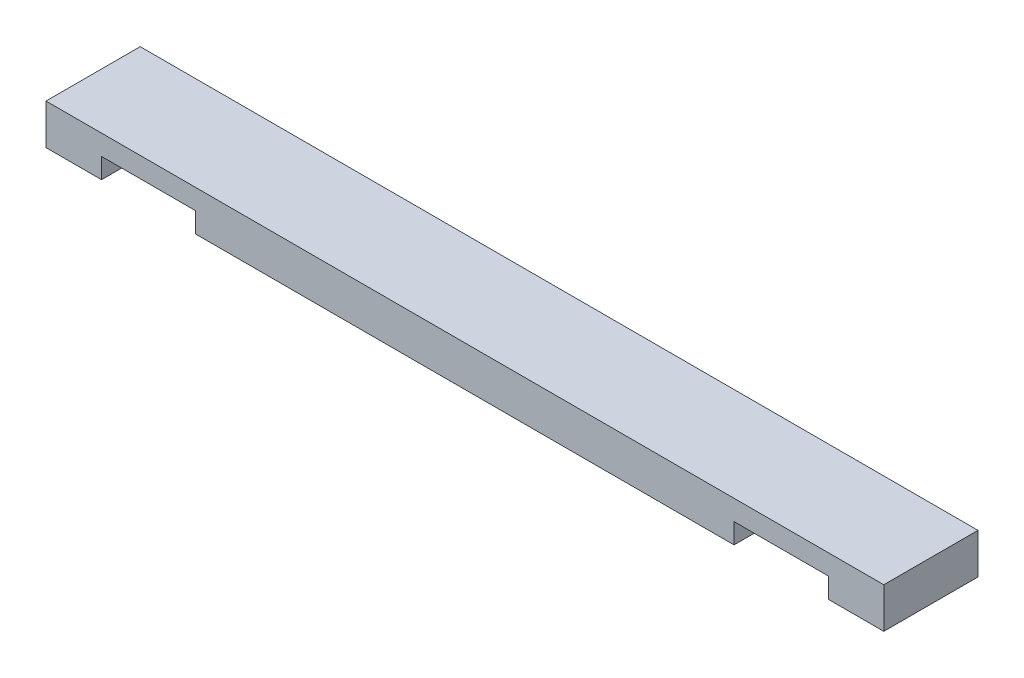
ISO-10303-21;
HEADER;
FILE_DESCRIPTION(('STEP AP214'),'2;1');
FILE_NAME('part.step','',(''),(''),'','','');
FILE_SCHEMA(('AUTOMOTIVE_DESIGN { 1 0 10303 214 1 1 1 1 }'));
ENDSEC;
DATA;
#1=APPLICATION_CONTEXT('core data for automotive mechanical design processes');
#2=APPLICATION_PROTOCOL_DEFINITION('international standard','automotive_design',2000,#1);
#3=PRODUCT_CONTEXT('',#1,'mechanical');
#4=PRODUCT('Part','Part','',(#3));
#5=PRODUCT_RELATED_PRODUCT_CATEGORY('part','',(#4));
#6=PRODUCT_DEFINITION_FORMATION('','',#4);
#7=PRODUCT_DEFINITION_CONTEXT('part definition',#1,'design');
#8=PRODUCT_DEFINITION('design','',#6,#7);
#9=PRODUCT_DEFINITION_SHAPE('','',#8);
#10=(LENGTH_UNIT() NAMED_UNIT(*) SI_UNIT(.MILLI.,.METRE.));
#11=(NAMED_UNIT(*) PLANE_ANGLE_UNIT() SI_UNIT($,.RADIAN.));
#12=(NAMED_UNIT(*) SI_UNIT($,.STERADIAN.) SOLID_ANGLE_UNIT());
#13=UNCERTAINTY_MEASURE_WITH_UNIT(LENGTH_MEASURE(1.E-05),#10,'distance_accuracy_value','');
#14=(GEOMETRIC_REPRESENTATION_CONTEXT(3) GLOBAL_UNCERTAINTY_ASSIGNED_CONTEXT((#13)) GLOBAL_UNIT_ASSIGNED_CONTEXT((#10,
#11,#12)) REPRESENTATION_CONTEXT('',''));
#15=CARTESIAN_POINT('',(0.,0.,0.));
#16=DIRECTION('',(0.,0.,1.));
#17=DIRECTION('',(1.,0.,0.));
#18=AXIS2_PLACEMENT_3D('',#15,#16,#17);
#19=CARTESIAN_POINT('',(0.,0.,0.));
#20=DIRECTION('',(0.,-1.,0.));
#21=DIRECTION('',(0.,0.,-1.));
#22=AXIS2_PLACEMENT_3D('',#19,#20,#21);
#23=PLANE('',#22);
#24=DIRECTION('',(0.,0.,1.));
#25=VECTOR('',#24,1.);
#26=CARTESIAN_POINT('',(738.187500000009,0.,-88.9));
#27=LINE('',#26,#25);
#28=CARTESIAN_POINT('',(738.187500000009,0.,-88.9));
#29=VERTEX_POINT('',#28);
#30=CARTESIAN_POINT('',(738.187500000009,0.,0.));
#31=VERTEX_POINT('',#30);
#32=EDGE_CURVE('E161',#29,#31,#27,.T.);
#33=ORIENTED_EDGE('',*,*,#32,.F.);
#34=DIRECTION('',(-1.,0.,0.));
#35=VECTOR('',#34,1.);
#36=CARTESIAN_POINT('',(0.,0.,-88.9));
#37=LINE('',#36,#35);
#38=CARTESIAN_POINT('',(790.575,0.,-88.9));
#39=VERTEX_POINT('',#38);
#40=EDGE_CURVE('E152',#39,#29,#37,.T.);
#41=ORIENTED_EDGE('',*,*,#40,.F.);
#42=DIRECTION('',(0.,0.,-1.));
#43=VECTOR('',#42,1.);
#44=CARTESIAN_POINT('',(790.575,0.,0.));
#45=LINE('',#44,#43);
#46=CARTESIAN_POINT('',(790.575,0.,0.));
#47=VERTEX_POINT('',#46);
#48=EDGE_CURVE('E206',#47,#39,#45,.T.);
#49=ORIENTED_EDGE('',*,*,#48,.F.);
#50=DIRECTION('',(1.,0.,0.));
#51=VECTOR('',#50,1.);
#52=CARTESIAN_POINT('',(0.,0.,0.));
#53=LINE('',#52,#51);
#54=EDGE_CURVE('E202',#31,#47,#53,.T.);
#55=ORIENTED_EDGE('',*,*,#54,.F.);
#56=EDGE_LOOP('',(#33,#41,#49,#55));
#57=FACE_BOUND('',#56,.T.);
#58=ADVANCED_FACE('F39',(#57),#23,.T.);
#59=DIRECTION('',(0.,0.,1.));
#60=VECTOR('',#59,1.);
#61=CARTESIAN_POINT('',(649.287500000009,0.,-88.9));
#62=LINE('',#61,#60);
#63=CARTESIAN_POINT('',(649.287500000009,0.,-88.9));
#64=VERTEX_POINT('',#63);
#65=CARTESIAN_POINT('',(649.287500000008,0.,0.));
#66=VERTEX_POINT('',#65);
#67=EDGE_CURVE('E164',#64,#66,#62,.T.);
#68=ORIENTED_EDGE('',*,*,#67,.T.);
#69=CARTESIAN_POINT('',(141.300199999996,0.,0.));
#70=VERTEX_POINT('',#69);
#71=EDGE_CURVE('E207',#70,#66,#53,.T.);
#72=ORIENTED_EDGE('',*,*,#71,.F.);
#73=DIRECTION('',(0.,0.,1.));
#74=VECTOR('',#73,1.);
#75=CARTESIAN_POINT('',(141.300199999996,0.,-88.9));
#76=LINE('',#75,#74);
#77=CARTESIAN_POINT('',(141.300199999996,0.,-88.9));
#78=VERTEX_POINT('',#77);
#79=EDGE_CURVE('E174',#78,#70,#76,.T.);
#80=ORIENTED_EDGE('',*,*,#79,.F.);
#81=EDGE_CURVE('E211',#64,#78,#37,.T.);
#82=ORIENTED_EDGE('',*,*,#81,.F.);
#83=EDGE_LOOP('',(#68,#72,#80,#82));
#84=FACE_BOUND('',#83,.T.);
#85=ADVANCED_FACE('F232',(#84),#23,.T.);
#86=CARTESIAN_POINT('',(0.,38.1,0.));
#87=DIRECTION('',(1.,0.,0.));
#88=DIRECTION('',(0.,0.,-1.));
#89=AXIS2_PLACEMENT_3D('',#86,#87,#88);
#90=PLANE('',#89);
#91=DIRECTION('',(0.,0.,1.));
#92=VECTOR('',#91,1.);
#93=CARTESIAN_POINT('',(0.,0.,0.));
#94=LINE('',#93,#92);
#95=CARTESIAN_POINT('',(0.,0.,-88.9));
#96=VERTEX_POINT('',#95);
#97=CARTESIAN_POINT('',(0.,0.,0.));
#98=VERTEX_POINT('',#97);
#99=EDGE_CURVE('E163',#96,#98,#94,.T.);
#100=ORIENTED_EDGE('',*,*,#99,.T.);
#101=DIRECTION('',(0.,-1.,0.));
#102=VECTOR('',#101,1.);
#103=CARTESIAN_POINT('',(0.,38.1,0.));
#104=LINE('',#103,#102);
#105=CARTESIAN_POINT('',(0.,38.1,0.));
#106=VERTEX_POINT('',#105);
#107=EDGE_CURVE('E11',#106,#98,#104,.T.);
#108=ORIENTED_EDGE('',*,*,#107,.F.);
#109=DIRECTION('',(0.,0.,1.));
#110=VECTOR('',#109,1.);
#111=CARTESIAN_POINT('',(0.,38.1,0.));
#112=LINE('',#111,#110);
#113=CARTESIAN_POINT('',(0.,38.1,-88.9));
#114=VERTEX_POINT('',#113);
#115=EDGE_CURVE('E190',#114,#106,#112,.T.);
#116=ORIENTED_EDGE('',*,*,#115,.F.);
#117=DIRECTION('',(0.,-1.,0.));
#118=VECTOR('',#117,1.);
#119=CARTESIAN_POINT('',(0.,38.1,-88.9));
#120=LINE('',#119,#118);
#121=EDGE_CURVE('E199',#114,#96,#120,.T.);
#122=ORIENTED_EDGE('',*,*,#121,.T.);
#123=EDGE_LOOP('',(#100,#108,#116,#122));
#124=FACE_BOUND('',#123,.T.);
#125=ADVANCED_FACE('F41',(#124),#90,.F.);
#126=CARTESIAN_POINT('',(0.,38.1,0.));
#127=DIRECTION('',(0.,0.,-1.));
#128=DIRECTION('',(-1.,0.,0.));
#129=AXIS2_PLACEMENT_3D('',#126,#127,#128);
#130=PLANE('',#129);
#131=DIRECTION('',(-1.,0.,0.));
#132=VECTOR('',#131,1.);
#133=CARTESIAN_POINT('',(738.187500000009,19.05,0.));
#134=LINE('',#133,#132);
#135=CARTESIAN_POINT('',(738.187500000009,19.05,0.));
#136=VERTEX_POINT('',#135);
#137=CARTESIAN_POINT('',(649.287500000009,19.05,0.));
#138=VERTEX_POINT('',#137);
#139=EDGE_CURVE('E154',#136,#138,#134,.T.);
#140=ORIENTED_EDGE('',*,*,#139,.F.);
#141=DIRECTION('',(0.,1.,0.));
#142=VECTOR('',#141,1.);
#143=CARTESIAN_POINT('',(738.187500000009,0.,0.));
#144=LINE('',#143,#142);
#145=EDGE_CURVE('E134',#31,#136,#144,.T.);
#146=ORIENTED_EDGE('',*,*,#145,.F.);
#147=ORIENTED_EDGE('',*,*,#54,.T.);
#148=DIRECTION('',(0.,-1.,0.));
#149=VECTOR('',#148,1.);
#150=CARTESIAN_POINT('',(790.575,38.1,0.));
#151=LINE('',#150,#149);
#152=CARTESIAN_POINT('',(790.575,38.1,0.));
#153=VERTEX_POINT('',#152);
#154=EDGE_CURVE('E47',#153,#47,#151,.T.);
#155=ORIENTED_EDGE('',*,*,#154,.F.);
#156=DIRECTION('',(1.,0.,0.));
#157=VECTOR('',#156,1.);
#158=CARTESIAN_POINT('',(0.,38.1,0.));
#159=LINE('',#158,#157);
#160=EDGE_CURVE('E193',#106,#153,#159,.T.);
#161=ORIENTED_EDGE('',*,*,#160,.F.);
#162=ORIENTED_EDGE('',*,*,#107,.T.);
#163=CARTESIAN_POINT('',(52.400199999996,0.,0.));
#164=VERTEX_POINT('',#163);
#165=EDGE_CURVE('E203',#98,#164,#53,.T.);
#166=ORIENTED_EDGE('',*,*,#165,.T.);
#167=DIRECTION('',(0.,-1.,0.));
#168=VECTOR('',#167,1.);
#169=CARTESIAN_POINT('',(52.400199999996,0.,0.));
#170=LINE('',#169,#168);
#171=CARTESIAN_POINT('',(52.400199999996,19.05,0.));
#172=VERTEX_POINT('',#171);
#173=EDGE_CURVE('E62',#172,#164,#170,.T.);
#174=ORIENTED_EDGE('',*,*,#173,.F.);
#175=DIRECTION('',(-1.,0.,0.));
#176=VECTOR('',#175,1.);
#177=CARTESIAN_POINT('',(141.300199999996,19.05,0.));
#178=LINE('',#177,#176);
#179=CARTESIAN_POINT('',(141.300199999996,19.05,0.));
#180=VERTEX_POINT('',#179);
#181=EDGE_CURVE('E177',#180,#172,#178,.T.);
#182=ORIENTED_EDGE('',*,*,#181,.F.);
#183=DIRECTION('',(0.,1.,0.));
#184=VECTOR('',#183,1.);
#185=CARTESIAN_POINT('',(141.300199999996,0.,0.));
#186=LINE('',#185,#184);
#187=EDGE_CURVE('E159',#70,#180,#186,.T.);
#188=ORIENTED_EDGE('',*,*,#187,.F.);
#189=ORIENTED_EDGE('',*,*,#71,.T.);
#190=DIRECTION('',(0.,-1.,0.));
#191=VECTOR('',#190,1.);
#192=CARTESIAN_POINT('',(649.287500000009,0.,0.));
#193=LINE('',#192,#191);
#194=EDGE_CURVE('E54',#138,#66,#193,.T.);
#195=ORIENTED_EDGE('',*,*,#194,.F.);
#196=EDGE_LOOP('',(#140,#146,#147,#155,#161,#162,#166,#174,#182,#188,#189,#195));
#197=FACE_BOUND('',#196,.T.);
#198=ADVANCED_FACE('F225',(#197),#130,.F.);
#199=CARTESIAN_POINT('',(790.575,38.1,0.));
#200=DIRECTION('',(-1.,0.,0.));
#201=DIRECTION('',(0.,0.,1.));
#202=AXIS2_PLACEMENT_3D('',#199,#200,#201);
#203=PLANE('',#202);
#204=ORIENTED_EDGE('',*,*,#48,.T.);
#205=DIRECTION('',(0.,-1.,0.));
#206=VECTOR('',#205,1.);
#207=CARTESIAN_POINT('',(790.575,38.1,-88.9));
#208=LINE('',#207,#206);
#209=CARTESIAN_POINT('',(790.575,38.1,-88.9));
#210=VERTEX_POINT('',#209);
#211=EDGE_CURVE('E214',#210,#39,#208,.T.);
#212=ORIENTED_EDGE('',*,*,#211,.F.);
#213=DIRECTION('',(0.,0.,-1.));
#214=VECTOR('',#213,1.);
#215=CARTESIAN_POINT('',(790.575,38.1,0.));
#216=LINE('',#215,#214);
#217=EDGE_CURVE('E195',#153,#210,#216,.T.);
#218=ORIENTED_EDGE('',*,*,#217,.F.);
#219=ORIENTED_EDGE('',*,*,#154,.T.);
#220=EDGE_LOOP('',(#204,#212,#218,#219));
#221=FACE_BOUND('',#220,.T.);
#222=ADVANCED_FACE('F220',(#221),#203,.F.);
#223=CARTESIAN_POINT('',(0.,38.1,-88.9));
#224=DIRECTION('',(0.,0.,1.));
#225=DIRECTION('',(1.,0.,0.));
#226=AXIS2_PLACEMENT_3D('',#223,#224,#225);
#227=PLANE('',#226);
#228=ORIENTED_EDGE('',*,*,#40,.T.);
#229=DIRECTION('',(0.,1.,0.));
#230=VECTOR('',#229,1.);
#231=CARTESIAN_POINT('',(738.187500000009,0.,-88.9));
#232=LINE('',#231,#230);
#233=CARTESIAN_POINT('',(738.187500000009,19.05,-88.9));
#234=VERTEX_POINT('',#233);
#235=EDGE_CURVE('E131',#29,#234,#232,.T.);
#236=ORIENTED_EDGE('',*,*,#235,.T.);
#237=DIRECTION('',(-1.,0.,0.));
#238=VECTOR('',#237,1.);
#239=CARTESIAN_POINT('',(738.187500000009,19.05,-88.9));
#240=LINE('',#239,#238);
#241=CARTESIAN_POINT('',(649.287500000009,19.05,-88.9));
#242=VERTEX_POINT('',#241);
#243=EDGE_CURVE('E142',#234,#242,#240,.T.);
#244=ORIENTED_EDGE('',*,*,#243,.T.);
#245=DIRECTION('',(0.,-1.,0.));
#246=VECTOR('',#245,1.);
#247=CARTESIAN_POINT('',(649.287500000009,0.,-88.9));
#248=LINE('',#247,#246);
#249=EDGE_CURVE('E139',#242,#64,#248,.T.);
#250=ORIENTED_EDGE('',*,*,#249,.T.);
#251=ORIENTED_EDGE('',*,*,#81,.T.);
#252=DIRECTION('',(0.,1.,0.));
#253=VECTOR('',#252,1.);
#254=CARTESIAN_POINT('',(141.300199999996,0.,-88.9));
#255=LINE('',#254,#253);
#256=CARTESIAN_POINT('',(141.300199999996,19.05,-88.9));
#257=VERTEX_POINT('',#256);
#258=EDGE_CURVE('E178',#78,#257,#255,.T.);
#259=ORIENTED_EDGE('',*,*,#258,.T.);
#260=DIRECTION('',(-1.,0.,0.));
#261=VECTOR('',#260,1.);
#262=CARTESIAN_POINT('',(141.300199999996,19.05,-88.9));
#263=LINE('',#262,#261);
#264=CARTESIAN_POINT('',(52.400199999996,19.05,-88.9));
#265=VERTEX_POINT('',#264);
#266=EDGE_CURVE('E185',#257,#265,#263,.T.);
#267=ORIENTED_EDGE('',*,*,#266,.T.);
#268=DIRECTION('',(0.,-1.,0.));
#269=VECTOR('',#268,1.);
#270=CARTESIAN_POINT('',(52.400199999996,0.,-88.9));
#271=LINE('',#270,#269);
#272=CARTESIAN_POINT('',(52.400199999996,0.,-88.9));
#273=VERTEX_POINT('',#272);
#274=EDGE_CURVE('E169',#265,#273,#271,.T.);
#275=ORIENTED_EDGE('',*,*,#274,.T.);
#276=EDGE_CURVE('E209',#273,#96,#37,.T.);
#277=ORIENTED_EDGE('',*,*,#276,.T.);
#278=ORIENTED_EDGE('',*,*,#121,.F.);
#279=DIRECTION('',(-1.,0.,0.));
#280=VECTOR('',#279,1.);
#281=CARTESIAN_POINT('',(0.,38.1,-88.9));
#282=LINE('',#281,#280);
#283=EDGE_CURVE('E197',#210,#114,#282,.T.);
#284=ORIENTED_EDGE('',*,*,#283,.F.);
#285=ORIENTED_EDGE('',*,*,#211,.T.);
#286=EDGE_LOOP('',(#228,#236,#244,#250,#251,#259,#267,#275,#277,#278,#284,#285));
#287=FACE_BOUND('',#286,.T.);
#288=ADVANCED_FACE('F149',(#287),#227,.F.);
#289=CARTESIAN_POINT('',(0.,38.1,0.));
#290=DIRECTION('',(0.,-1.,0.));
#291=DIRECTION('',(0.,0.,-1.));
#292=AXIS2_PLACEMENT_3D('',#289,#290,#291);
#293=PLANE('',#292);
#294=ORIENTED_EDGE('',*,*,#115,.T.);
#295=ORIENTED_EDGE('',*,*,#160,.T.);
#296=ORIENTED_EDGE('',*,*,#217,.T.);
#297=ORIENTED_EDGE('',*,*,#283,.T.);
#298=EDGE_LOOP('',(#294,#295,#296,#297));
#299=FACE_BOUND('',#298,.T.);
#300=ADVANCED_FACE('F247',(#299),#293,.F.);
#301=DIRECTION('',(0.,0.,1.));
#302=VECTOR('',#301,1.);
#303=CARTESIAN_POINT('',(52.400199999996,0.,-88.9));
#304=LINE('',#303,#302);
#305=EDGE_CURVE('E172',#273,#164,#304,.T.);
#306=ORIENTED_EDGE('',*,*,#305,.T.);
#307=ORIENTED_EDGE('',*,*,#165,.F.);
#308=ORIENTED_EDGE('',*,*,#99,.F.);
#309=ORIENTED_EDGE('',*,*,#276,.F.);
#310=EDGE_LOOP('',(#306,#307,#308,#309));
#311=FACE_BOUND('',#310,.T.);
#312=ADVANCED_FACE('F245',(#311),#23,.T.);
#313=CARTESIAN_POINT('',(141.300199999996,0.,-88.9));
#314=DIRECTION('',(1.,0.,0.));
#315=DIRECTION('',(0.,0.,-1.));
#316=AXIS2_PLACEMENT_3D('',#313,#314,#315);
#317=PLANE('',#316);
#318=ORIENTED_EDGE('',*,*,#187,.T.);
#319=DIRECTION('',(0.,0.,1.));
#320=VECTOR('',#319,1.);
#321=CARTESIAN_POINT('',(141.300199999996,19.05,-88.9));
#322=LINE('',#321,#320);
#323=EDGE_CURVE('E167',#257,#180,#322,.T.);
#324=ORIENTED_EDGE('',*,*,#323,.F.);
#325=ORIENTED_EDGE('',*,*,#258,.F.);
#326=ORIENTED_EDGE('',*,*,#79,.T.);
#327=EDGE_LOOP('',(#318,#324,#325,#326));
#328=FACE_BOUND('',#327,.T.);
#329=ADVANCED_FACE('F255',(#328),#317,.F.);
#330=CARTESIAN_POINT('',(52.400199999996,0.,-88.9));
#331=DIRECTION('',(-1.,0.,0.));
#332=DIRECTION('',(0.,0.,1.));
#333=AXIS2_PLACEMENT_3D('',#330,#331,#332);
#334=PLANE('',#333);
#335=ORIENTED_EDGE('',*,*,#173,.T.);
#336=ORIENTED_EDGE('',*,*,#305,.F.);
#337=ORIENTED_EDGE('',*,*,#274,.F.);
#338=DIRECTION('',(0.,0.,1.));
#339=VECTOR('',#338,1.);
#340=CARTESIAN_POINT('',(52.400199999996,19.05,-88.9));
#341=LINE('',#340,#339);
#342=EDGE_CURVE('E170',#265,#172,#341,.T.);
#343=ORIENTED_EDGE('',*,*,#342,.T.);
#344=EDGE_LOOP('',(#335,#336,#337,#343));
#345=FACE_BOUND('',#344,.T.);
#346=ADVANCED_FACE('F313',(#345),#334,.F.);
#347=CARTESIAN_POINT('',(141.300199999996,19.05,-88.9));
#348=DIRECTION('',(0.,1.,0.));
#349=DIRECTION('',(-1.,0.,0.));
#350=AXIS2_PLACEMENT_3D('',#347,#348,#349);
#351=PLANE('',#350);
#352=ORIENTED_EDGE('',*,*,#181,.T.);
#353=ORIENTED_EDGE('',*,*,#342,.F.);
#354=ORIENTED_EDGE('',*,*,#266,.F.);
#355=ORIENTED_EDGE('',*,*,#323,.T.);
#356=EDGE_LOOP('',(#352,#353,#354,#355));
#357=FACE_BOUND('',#356,.T.);
#358=ADVANCED_FACE('F323',(#357),#351,.F.);
#359=CARTESIAN_POINT('',(738.187500000009,0.,-88.9));
#360=DIRECTION('',(1.,0.,0.));
#361=DIRECTION('',(0.,0.,-1.));
#362=AXIS2_PLACEMENT_3D('',#359,#360,#361);
#363=PLANE('',#362);
#364=ORIENTED_EDGE('',*,*,#145,.T.);
#365=DIRECTION('',(0.,0.,1.));
#366=VECTOR('',#365,1.);
#367=CARTESIAN_POINT('',(738.187500000009,19.05,-88.9));
#368=LINE('',#367,#366);
#369=EDGE_CURVE('E127',#234,#136,#368,.T.);
#370=ORIENTED_EDGE('',*,*,#369,.F.);
#371=ORIENTED_EDGE('',*,*,#235,.F.);
#372=ORIENTED_EDGE('',*,*,#32,.T.);
#373=EDGE_LOOP('',(#364,#370,#371,#372));
#374=FACE_BOUND('',#373,.T.);
#375=ADVANCED_FACE('F129',(#374),#363,.F.);
#376=CARTESIAN_POINT('',(649.287500000009,0.,-88.9));
#377=DIRECTION('',(-1.,0.,0.));
#378=DIRECTION('',(0.,0.,1.));
#379=AXIS2_PLACEMENT_3D('',#376,#377,#378);
#380=PLANE('',#379);
#381=ORIENTED_EDGE('',*,*,#194,.T.);
#382=ORIENTED_EDGE('',*,*,#67,.F.);
#383=ORIENTED_EDGE('',*,*,#249,.F.);
#384=DIRECTION('',(0.,0.,1.));
#385=VECTOR('',#384,1.);
#386=CARTESIAN_POINT('',(649.287500000009,19.05,-88.9));
#387=LINE('',#386,#385);
#388=EDGE_CURVE('E138',#242,#138,#387,.T.);
#389=ORIENTED_EDGE('',*,*,#388,.T.);
#390=EDGE_LOOP('',(#381,#382,#383,#389));
#391=FACE_BOUND('',#390,.T.);
#392=ADVANCED_FACE('F235',(#391),#380,.F.);
#393=CARTESIAN_POINT('',(738.187500000009,19.05,-88.9));
#394=DIRECTION('',(0.,1.,0.));
#395=DIRECTION('',(-1.,0.,0.));
#396=AXIS2_PLACEMENT_3D('',#393,#394,#395);
#397=PLANE('',#396);
#398=ORIENTED_EDGE('',*,*,#139,.T.);
#399=ORIENTED_EDGE('',*,*,#388,.F.);
#400=ORIENTED_EDGE('',*,*,#243,.F.);
#401=ORIENTED_EDGE('',*,*,#369,.T.);
#402=EDGE_LOOP('',(#398,#399,#400,#401));
#403=FACE_BOUND('',#402,.T.);
#404=ADVANCED_FACE('F143',(#403),#397,.F.);
#405=CLOSED_SHELL('',(#58,#85,#125,#198,#222,#288,#300,#312,#329,#346,#358,#375,#392,#404));
#406=MANIFOLD_SOLID_BREP('B2',#405);
#407=ADVANCED_BREP_SHAPE_REPRESENTATION('',(#18,#406),#14);
#408=SHAPE_DEFINITION_REPRESENTATION(#9,#407);
ENDSEC;
END-ISO-10303-21;
